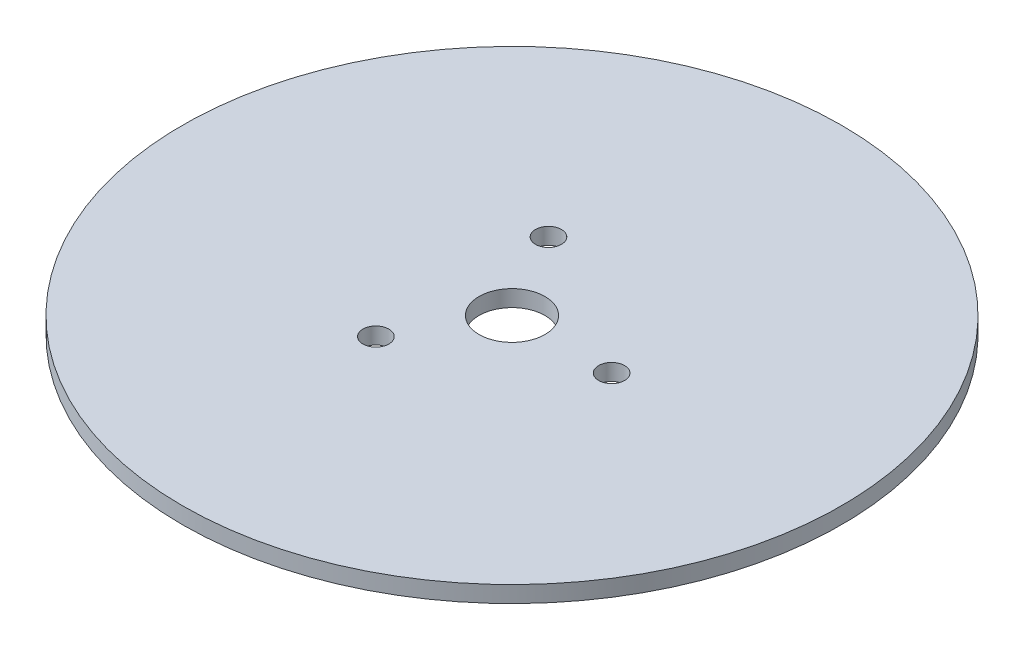
ISO-10303-21;
HEADER;
FILE_DESCRIPTION(('STEP AP214'),'2;1');
FILE_NAME('part.step','',(''),(''),'','','');
FILE_SCHEMA(('AUTOMOTIVE_DESIGN { 1 0 10303 214 1 1 1 1 }'));
ENDSEC;
DATA;
#1=APPLICATION_CONTEXT('core data for automotive mechanical design processes');
#2=APPLICATION_PROTOCOL_DEFINITION('international standard','automotive_design',2000,#1);
#3=PRODUCT_CONTEXT('',#1,'mechanical');
#4=PRODUCT('Part','Part','',(#3));
#5=PRODUCT_RELATED_PRODUCT_CATEGORY('part','',(#4));
#6=PRODUCT_DEFINITION_FORMATION('','',#4);
#7=PRODUCT_DEFINITION_CONTEXT('part definition',#1,'design');
#8=PRODUCT_DEFINITION('design','',#6,#7);
#9=PRODUCT_DEFINITION_SHAPE('','',#8);
#10=(LENGTH_UNIT() NAMED_UNIT(*) SI_UNIT(.MILLI.,.METRE.));
#11=(NAMED_UNIT(*) PLANE_ANGLE_UNIT() SI_UNIT($,.RADIAN.));
#12=(NAMED_UNIT(*) SI_UNIT($,.STERADIAN.) SOLID_ANGLE_UNIT());
#13=UNCERTAINTY_MEASURE_WITH_UNIT(LENGTH_MEASURE(1.E-05),#10,'distance_accuracy_value','');
#14=(GEOMETRIC_REPRESENTATION_CONTEXT(3) GLOBAL_UNCERTAINTY_ASSIGNED_CONTEXT((#13)) GLOBAL_UNIT_ASSIGNED_CONTEXT((#10,
#11,#12)) REPRESENTATION_CONTEXT('',''));
#15=CARTESIAN_POINT('',(0.,0.,0.));
#16=DIRECTION('',(0.,0.,1.));
#17=DIRECTION('',(1.,0.,0.));
#18=AXIS2_PLACEMENT_3D('',#15,#16,#17);
#19=CARTESIAN_POINT('',(0.,3.175,0.));
#20=DIRECTION('',(0.,1.,0.));
#21=DIRECTION('',(0.,0.,1.));
#22=AXIS2_PLACEMENT_3D('',#19,#20,#21);
#23=PLANE('',#22);
#24=CARTESIAN_POINT('',(-9.59999999999985,3.175,16.6276877526613));
#25=DIRECTION('',(0.,1.,0.));
#26=DIRECTION('',(0.,0.,1.));
#27=AXIS2_PLACEMENT_3D('',#24,#25,#26);
#28=CIRCLE('',#27,2.5);
#29=CARTESIAN_POINT('',(-9.59999999999985,3.175,19.1276877526613));
#30=VERTEX_POINT('',#29);
#31=EDGE_CURVE('E61',#30,#30,#28,.T.);
#32=ORIENTED_EDGE('',*,*,#31,.F.);
#33=EDGE_LOOP('',(#32));
#34=FACE_BOUND('',#33,.T.);
#35=CARTESIAN_POINT('',(19.2,3.175,0.));
#36=DIRECTION('',(0.,1.,0.));
#37=DIRECTION('',(0.,0.,1.));
#38=AXIS2_PLACEMENT_3D('',#35,#36,#37);
#39=CIRCLE('',#38,2.5);
#40=CARTESIAN_POINT('',(19.2,3.175,2.5));
#41=VERTEX_POINT('',#40);
#42=EDGE_CURVE('E47',#41,#41,#39,.T.);
#43=ORIENTED_EDGE('',*,*,#42,.F.);
#44=EDGE_LOOP('',(#43));
#45=FACE_BOUND('',#44,.T.);
#46=CARTESIAN_POINT('',(0.,3.175,0.));
#47=DIRECTION('',(0.,1.,0.));
#48=DIRECTION('',(0.,0.,1.));
#49=AXIS2_PLACEMENT_3D('',#46,#47,#48);
#50=CIRCLE('',#49,63.5);
#51=CARTESIAN_POINT('',(0.,3.175,63.5));
#52=VERTEX_POINT('',#51);
#53=EDGE_CURVE('E10',#52,#52,#50,.T.);
#54=ORIENTED_EDGE('',*,*,#53,.T.);
#55=EDGE_LOOP('',(#54));
#56=FACE_BOUND('',#55,.T.);
#57=CARTESIAN_POINT('',(-9.60000000000008,3.175,-16.6276877526612));
#58=DIRECTION('',(0.,1.,0.));
#59=DIRECTION('',(0.,0.,1.));
#60=AXIS2_PLACEMENT_3D('',#57,#58,#59);
#61=CIRCLE('',#60,2.5);
#62=CARTESIAN_POINT('',(-9.60000000000008,3.175,-14.1276877526612));
#63=VERTEX_POINT('',#62);
#64=EDGE_CURVE('E53',#63,#63,#61,.T.);
#65=ORIENTED_EDGE('',*,*,#64,.F.);
#66=EDGE_LOOP('',(#65));
#67=FACE_BOUND('',#66,.T.);
#68=CARTESIAN_POINT('',(0.,3.175,0.));
#69=DIRECTION('',(0.,1.,0.));
#70=DIRECTION('',(0.,0.,1.));
#71=AXIS2_PLACEMENT_3D('',#68,#69,#70);
#72=CIRCLE('',#71,6.35);
#73=CARTESIAN_POINT('',(0.,3.175,6.35));
#74=VERTEX_POINT('',#73);
#75=EDGE_CURVE('E69',#74,#74,#72,.T.);
#76=ORIENTED_EDGE('',*,*,#75,.F.);
#77=EDGE_LOOP('',(#76));
#78=FACE_BOUND('',#77,.T.);
#79=ADVANCED_FACE('F34',(#34,#45,#56,#67,#78),#23,.T.);
#80=CARTESIAN_POINT('',(0.,0.,0.));
#81=DIRECTION('',(0.,1.,0.));
#82=DIRECTION('',(0.,0.,1.));
#83=AXIS2_PLACEMENT_3D('',#80,#81,#82);
#84=PLANE('',#83);
#85=CARTESIAN_POINT('',(0.,0.,0.));
#86=DIRECTION('',(0.,1.,0.));
#87=DIRECTION('',(0.,0.,1.));
#88=AXIS2_PLACEMENT_3D('',#85,#86,#87);
#89=CIRCLE('',#88,63.5);
#90=CARTESIAN_POINT('',(0.,0.,63.5));
#91=VERTEX_POINT('',#90);
#92=EDGE_CURVE('E38',#91,#91,#89,.T.);
#93=ORIENTED_EDGE('',*,*,#92,.F.);
#94=EDGE_LOOP('',(#93));
#95=FACE_BOUND('',#94,.T.);
#96=CARTESIAN_POINT('',(19.2,0.,0.));
#97=DIRECTION('',(0.,1.,0.));
#98=DIRECTION('',(0.,0.,1.));
#99=AXIS2_PLACEMENT_3D('',#96,#97,#98);
#100=CIRCLE('',#99,2.5);
#101=CARTESIAN_POINT('',(19.2,0.,2.5));
#102=VERTEX_POINT('',#101);
#103=EDGE_CURVE('E49',#102,#102,#100,.T.);
#104=ORIENTED_EDGE('',*,*,#103,.T.);
#105=EDGE_LOOP('',(#104));
#106=FACE_BOUND('',#105,.T.);
#107=CARTESIAN_POINT('',(-9.60000000000008,0.,-16.6276877526612));
#108=DIRECTION('',(0.,1.,0.));
#109=DIRECTION('',(0.,0.,1.));
#110=AXIS2_PLACEMENT_3D('',#107,#108,#109);
#111=CIRCLE('',#110,2.5);
#112=CARTESIAN_POINT('',(-9.60000000000008,0.,-14.1276877526612));
#113=VERTEX_POINT('',#112);
#114=EDGE_CURVE('E57',#113,#113,#111,.T.);
#115=ORIENTED_EDGE('',*,*,#114,.T.);
#116=EDGE_LOOP('',(#115));
#117=FACE_BOUND('',#116,.T.);
#118=CARTESIAN_POINT('',(-9.59999999999985,0.,16.6276877526613));
#119=DIRECTION('',(0.,1.,0.));
#120=DIRECTION('',(0.,0.,1.));
#121=AXIS2_PLACEMENT_3D('',#118,#119,#120);
#122=CIRCLE('',#121,2.5);
#123=CARTESIAN_POINT('',(-9.59999999999985,0.,19.1276877526613));
#124=VERTEX_POINT('',#123);
#125=EDGE_CURVE('E65',#124,#124,#122,.T.);
#126=ORIENTED_EDGE('',*,*,#125,.T.);
#127=EDGE_LOOP('',(#126));
#128=FACE_BOUND('',#127,.T.);
#129=CARTESIAN_POINT('',(0.,0.,0.));
#130=DIRECTION('',(0.,1.,0.));
#131=DIRECTION('',(0.,0.,1.));
#132=AXIS2_PLACEMENT_3D('',#129,#130,#131);
#133=CIRCLE('',#132,6.35);
#134=CARTESIAN_POINT('',(0.,0.,6.35));
#135=VERTEX_POINT('',#134);
#136=EDGE_CURVE('E73',#135,#135,#133,.T.);
#137=ORIENTED_EDGE('',*,*,#136,.T.);
#138=EDGE_LOOP('',(#137));
#139=FACE_BOUND('',#138,.T.);
#140=ADVANCED_FACE('F85',(#95,#106,#117,#128,#139),#84,.F.);
#141=CARTESIAN_POINT('',(0.,3.175,0.));
#142=DIRECTION('',(0.,-1.,0.));
#143=DIRECTION('',(0.,0.,-1.));
#144=AXIS2_PLACEMENT_3D('',#141,#142,#143);
#145=CYLINDRICAL_SURFACE('',#144,63.5);
#146=ORIENTED_EDGE('',*,*,#53,.F.);
#147=EDGE_LOOP('',(#146));
#148=FACE_BOUND('',#147,.T.);
#149=ORIENTED_EDGE('',*,*,#92,.T.);
#150=EDGE_LOOP('',(#149));
#151=FACE_BOUND('',#150,.T.);
#152=ADVANCED_FACE('F36',(#148,#151),#145,.T.);
#153=CARTESIAN_POINT('',(19.2,3.175,0.));
#154=DIRECTION('',(0.,-1.,0.));
#155=DIRECTION('',(0.,0.,-1.));
#156=AXIS2_PLACEMENT_3D('',#153,#154,#155);
#157=CYLINDRICAL_SURFACE('',#156,2.5);
#158=ORIENTED_EDGE('',*,*,#42,.T.);
#159=EDGE_LOOP('',(#158));
#160=FACE_BOUND('',#159,.T.);
#161=ORIENTED_EDGE('',*,*,#103,.F.);
#162=EDGE_LOOP('',(#161));
#163=FACE_BOUND('',#162,.T.);
#164=ADVANCED_FACE('F95',(#160,#163),#157,.F.);
#165=CARTESIAN_POINT('',(-9.60000000000008,3.175,-16.6276877526612));
#166=DIRECTION('',(0.,-1.,0.));
#167=DIRECTION('',(0.,0.,-1.));
#168=AXIS2_PLACEMENT_3D('',#165,#166,#167);
#169=CYLINDRICAL_SURFACE('',#168,2.5);
#170=ORIENTED_EDGE('',*,*,#64,.T.);
#171=EDGE_LOOP('',(#170));
#172=FACE_BOUND('',#171,.T.);
#173=ORIENTED_EDGE('',*,*,#114,.F.);
#174=EDGE_LOOP('',(#173));
#175=FACE_BOUND('',#174,.T.);
#176=ADVANCED_FACE('F98',(#172,#175),#169,.F.);
#177=CARTESIAN_POINT('',(-9.59999999999985,3.175,16.6276877526613));
#178=DIRECTION('',(0.,-1.,0.));
#179=DIRECTION('',(0.,0.,-1.));
#180=AXIS2_PLACEMENT_3D('',#177,#178,#179);
#181=CYLINDRICAL_SURFACE('',#180,2.5);
#182=ORIENTED_EDGE('',*,*,#31,.T.);
#183=EDGE_LOOP('',(#182));
#184=FACE_BOUND('',#183,.T.);
#185=ORIENTED_EDGE('',*,*,#125,.F.);
#186=EDGE_LOOP('',(#185));
#187=FACE_BOUND('',#186,.T.);
#188=ADVANCED_FACE('F102',(#184,#187),#181,.F.);
#189=CARTESIAN_POINT('',(0.,3.175,0.));
#190=DIRECTION('',(0.,-1.,0.));
#191=DIRECTION('',(0.,0.,-1.));
#192=AXIS2_PLACEMENT_3D('',#189,#190,#191);
#193=CYLINDRICAL_SURFACE('',#192,6.35);
#194=ORIENTED_EDGE('',*,*,#75,.T.);
#195=EDGE_LOOP('',(#194));
#196=FACE_BOUND('',#195,.T.);
#197=ORIENTED_EDGE('',*,*,#136,.F.);
#198=EDGE_LOOP('',(#197));
#199=FACE_BOUND('',#198,.T.);
#200=ADVANCED_FACE('F81',(#196,#199),#193,.F.);
#201=CLOSED_SHELL('',(#79,#140,#152,#164,#176,#188,#200));
#202=MANIFOLD_SOLID_BREP('B2',#201);
#203=ADVANCED_BREP_SHAPE_REPRESENTATION('',(#18,#202),#14);
#204=SHAPE_DEFINITION_REPRESENTATION(#9,#203);
ENDSEC;
END-ISO-10303-21;
